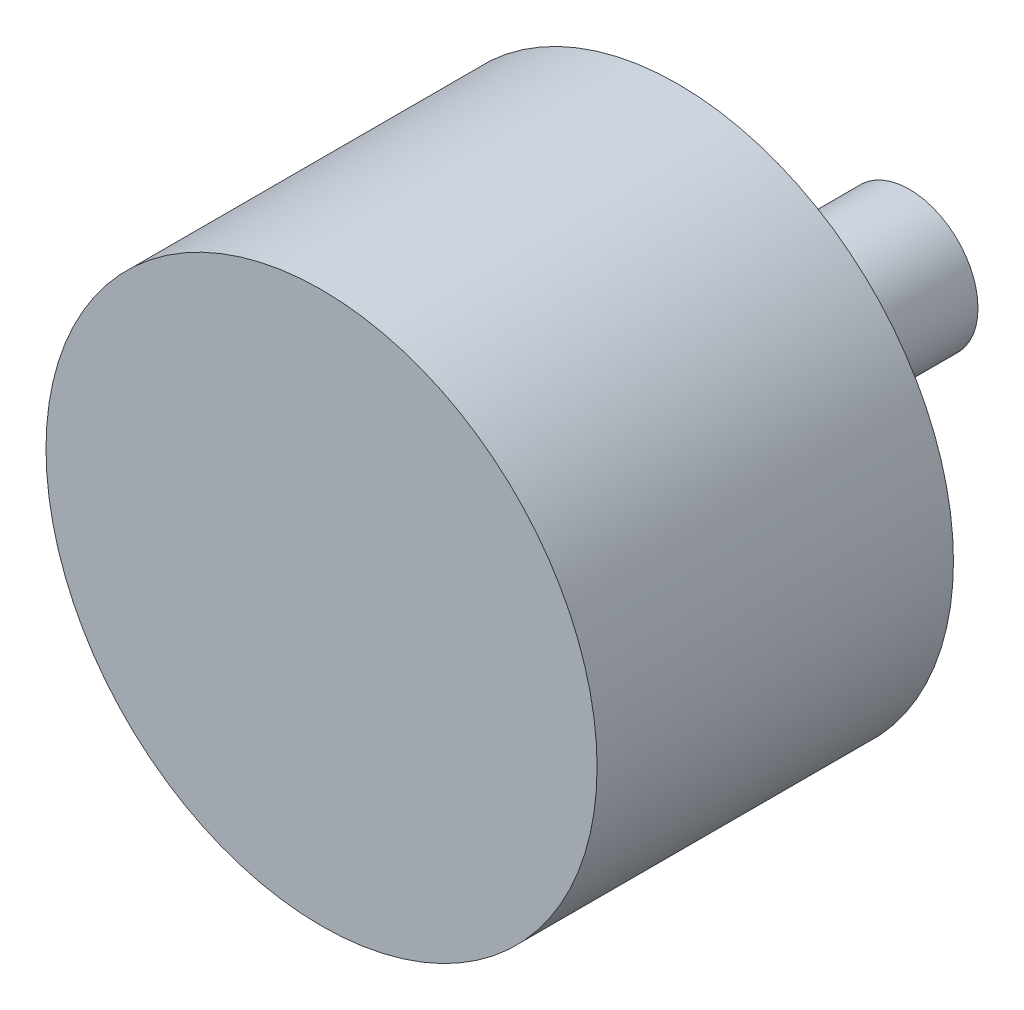
ISO-10303-21;
HEADER;
FILE_DESCRIPTION(('STEP AP214'),'2;1');
FILE_NAME('part.step','',(''),(''),'','','');
FILE_SCHEMA(('AUTOMOTIVE_DESIGN { 1 0 10303 214 1 1 1 1 }'));
ENDSEC;
DATA;
#1=APPLICATION_CONTEXT('core data for automotive mechanical design processes');
#2=APPLICATION_PROTOCOL_DEFINITION('international standard','automotive_design',2000,#1);
#3=PRODUCT_CONTEXT('',#1,'mechanical');
#4=PRODUCT('Part','Part','',(#3));
#5=PRODUCT_RELATED_PRODUCT_CATEGORY('part','',(#4));
#6=PRODUCT_DEFINITION_FORMATION('','',#4);
#7=PRODUCT_DEFINITION_CONTEXT('part definition',#1,'design');
#8=PRODUCT_DEFINITION('design','',#6,#7);
#9=PRODUCT_DEFINITION_SHAPE('','',#8);
#10=(LENGTH_UNIT() NAMED_UNIT(*) SI_UNIT(.MILLI.,.METRE.));
#11=(NAMED_UNIT(*) PLANE_ANGLE_UNIT() SI_UNIT($,.RADIAN.));
#12=(NAMED_UNIT(*) SI_UNIT($,.STERADIAN.) SOLID_ANGLE_UNIT());
#13=UNCERTAINTY_MEASURE_WITH_UNIT(LENGTH_MEASURE(1.E-05),#10,'distance_accuracy_value','');
#14=(GEOMETRIC_REPRESENTATION_CONTEXT(3) GLOBAL_UNCERTAINTY_ASSIGNED_CONTEXT((#13)) GLOBAL_UNIT_ASSIGNED_CONTEXT((#10,
#11,#12)) REPRESENTATION_CONTEXT('',''));
#15=CARTESIAN_POINT('',(0.,0.,0.));
#16=DIRECTION('',(0.,0.,1.));
#17=DIRECTION('',(1.,0.,0.));
#18=AXIS2_PLACEMENT_3D('',#15,#16,#17);
#19=CARTESIAN_POINT('',(0.,0.,0.));
#20=DIRECTION('',(0.,0.,-1.));
#21=DIRECTION('',(-1.,0.,0.));
#22=AXIS2_PLACEMENT_3D('',#19,#20,#21);
#23=PLANE('',#22);
#24=CARTESIAN_POINT('',(0.,0.,0.));
#25=DIRECTION('',(0.,0.,1.));
#26=DIRECTION('',(1.,0.,0.));
#27=AXIS2_PLACEMENT_3D('',#24,#25,#26);
#28=CIRCLE('',#27,19.05);
#29=CARTESIAN_POINT('',(19.05,0.,0.));
#30=VERTEX_POINT('',#29);
#31=EDGE_CURVE('E10',#30,#30,#28,.T.);
#32=ORIENTED_EDGE('',*,*,#31,.T.);
#33=EDGE_LOOP('',(#32));
#34=FACE_BOUND('',#33,.T.);
#35=ADVANCED_FACE('F32',(#34),#23,.F.);
#36=CARTESIAN_POINT('',(0.,0.,0.));
#37=DIRECTION('',(0.,0.,1.));
#38=DIRECTION('',(1.,0.,0.));
#39=AXIS2_PLACEMENT_3D('',#36,#37,#38);
#40=CYLINDRICAL_SURFACE('',#39,19.05);
#41=ORIENTED_EDGE('',*,*,#31,.F.);
#42=EDGE_LOOP('',(#41));
#43=FACE_BOUND('',#42,.T.);
#44=CARTESIAN_POINT('',(0.,0.,-24.638));
#45=DIRECTION('',(0.,0.,1.));
#46=DIRECTION('',(1.,0.,0.));
#47=AXIS2_PLACEMENT_3D('',#44,#45,#46);
#48=CIRCLE('',#47,19.05);
#49=CARTESIAN_POINT('',(19.05,0.,-24.638));
#50=VERTEX_POINT('',#49);
#51=EDGE_CURVE('E38',#50,#50,#48,.T.);
#52=ORIENTED_EDGE('',*,*,#51,.T.);
#53=EDGE_LOOP('',(#52));
#54=FACE_BOUND('',#53,.T.);
#55=ADVANCED_FACE('F70',(#43,#54),#40,.T.);
#56=CARTESIAN_POINT('',(0.,19.05,-24.638));
#57=DIRECTION('',(0.,0.,1.));
#58=DIRECTION('',(1.,0.,0.));
#59=AXIS2_PLACEMENT_3D('',#56,#57,#58);
#60=PLANE('',#59);
#61=ORIENTED_EDGE('',*,*,#51,.F.);
#62=EDGE_LOOP('',(#61));
#63=FACE_BOUND('',#62,.T.);
#64=CARTESIAN_POINT('',(0.,0.,-24.638));
#65=DIRECTION('',(0.,0.,1.));
#66=DIRECTION('',(1.,0.,0.));
#67=AXIS2_PLACEMENT_3D('',#64,#65,#66);
#68=CIRCLE('',#67,5.461);
#69=CARTESIAN_POINT('',(5.461,0.,-24.638));
#70=VERTEX_POINT('',#69);
#71=EDGE_CURVE('E42',#70,#70,#68,.T.);
#72=ORIENTED_EDGE('',*,*,#71,.T.);
#73=EDGE_LOOP('',(#72));
#74=FACE_BOUND('',#73,.T.);
#75=ADVANCED_FACE('F74',(#63,#74),#60,.F.);
#76=CARTESIAN_POINT('',(0.,0.,0.));
#77=DIRECTION('',(0.,0.,1.));
#78=DIRECTION('',(1.,0.,0.));
#79=AXIS2_PLACEMENT_3D('',#76,#77,#78);
#80=CYLINDRICAL_SURFACE('',#79,5.461);
#81=ORIENTED_EDGE('',*,*,#71,.F.);
#82=EDGE_LOOP('',(#81));
#83=FACE_BOUND('',#82,.T.);
#84=CARTESIAN_POINT('',(0.,0.,-30.48));
#85=DIRECTION('',(0.,0.,1.));
#86=DIRECTION('',(1.,0.,0.));
#87=AXIS2_PLACEMENT_3D('',#84,#85,#86);
#88=CIRCLE('',#87,5.461);
#89=CARTESIAN_POINT('',(5.461,0.,-30.48));
#90=VERTEX_POINT('',#89);
#91=EDGE_CURVE('E46',#90,#90,#88,.T.);
#92=ORIENTED_EDGE('',*,*,#91,.T.);
#93=EDGE_LOOP('',(#92));
#94=FACE_BOUND('',#93,.T.);
#95=ADVANCED_FACE('F79',(#83,#94),#80,.T.);
#96=CARTESIAN_POINT('',(0.,5.461,-30.48));
#97=DIRECTION('',(0.,0.,1.));
#98=DIRECTION('',(1.,0.,0.));
#99=AXIS2_PLACEMENT_3D('',#96,#97,#98);
#100=PLANE('',#99);
#101=ORIENTED_EDGE('',*,*,#91,.F.);
#102=EDGE_LOOP('',(#101));
#103=FACE_BOUND('',#102,.T.);
#104=CARTESIAN_POINT('',(0.,0.,-30.48));
#105=DIRECTION('',(0.,0.,1.));
#106=DIRECTION('',(1.,0.,0.));
#107=AXIS2_PLACEMENT_3D('',#104,#105,#106);
#108=CIRCLE('',#107,4.74472);
#109=CARTESIAN_POINT('',(4.74472,0.,-30.48));
#110=VERTEX_POINT('',#109);
#111=EDGE_CURVE('E51',#110,#110,#108,.T.);
#112=ORIENTED_EDGE('',*,*,#111,.T.);
#113=EDGE_LOOP('',(#112));
#114=FACE_BOUND('',#113,.T.);
#115=ADVANCED_FACE('F66',(#103,#114),#100,.F.);
#116=CARTESIAN_POINT('',(0.,0.,0.));
#117=DIRECTION('',(0.,0.,1.));
#118=DIRECTION('',(1.,0.,0.));
#119=AXIS2_PLACEMENT_3D('',#116,#117,#118);
#120=CYLINDRICAL_SURFACE('',#119,4.74472);
#121=ORIENTED_EDGE('',*,*,#111,.F.);
#122=EDGE_LOOP('',(#121));
#123=FACE_BOUND('',#122,.T.);
#124=CARTESIAN_POINT('',(0.,0.,-40.64));
#125=DIRECTION('',(0.,0.,1.));
#126=DIRECTION('',(1.,0.,0.));
#127=AXIS2_PLACEMENT_3D('',#124,#125,#126);
#128=CIRCLE('',#127,4.74472);
#129=CARTESIAN_POINT('',(4.74472,0.,-40.64));
#130=VERTEX_POINT('',#129);
#131=EDGE_CURVE('E54',#130,#130,#128,.T.);
#132=ORIENTED_EDGE('',*,*,#131,.T.);
#133=EDGE_LOOP('',(#132));
#134=FACE_BOUND('',#133,.T.);
#135=ADVANCED_FACE('F58',(#123,#134),#120,.T.);
#136=CARTESIAN_POINT('',(0.,4.74472,-40.64));
#137=DIRECTION('',(0.,0.,1.));
#138=DIRECTION('',(1.,0.,0.));
#139=AXIS2_PLACEMENT_3D('',#136,#137,#138);
#140=PLANE('',#139);
#141=ORIENTED_EDGE('',*,*,#131,.F.);
#142=EDGE_LOOP('',(#141));
#143=FACE_BOUND('',#142,.T.);
#144=ADVANCED_FACE('F60',(#143),#140,.F.);
#145=CLOSED_SHELL('',(#35,#55,#75,#95,#115,#135,#144));
#146=MANIFOLD_SOLID_BREP('B2',#145);
#147=ADVANCED_BREP_SHAPE_REPRESENTATION('',(#18,#146),#14);
#148=SHAPE_DEFINITION_REPRESENTATION(#9,#147);
ENDSEC;
END-ISO-10303-21;
